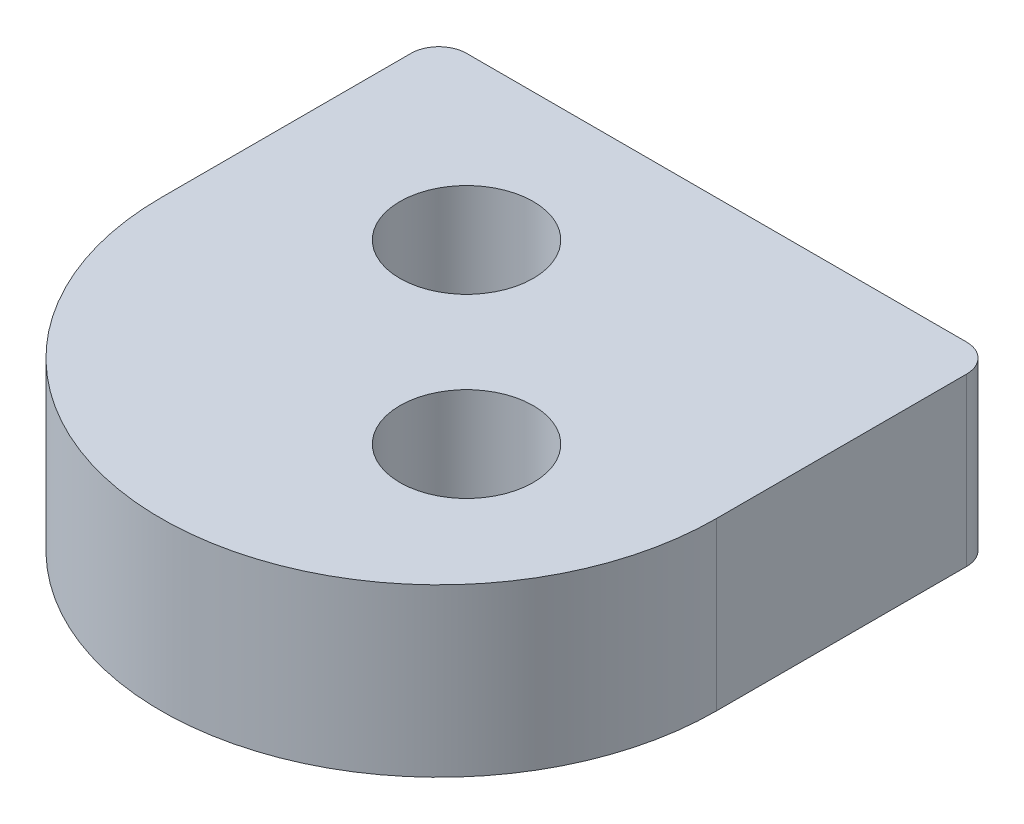
ISO-10303-21;
HEADER;
FILE_DESCRIPTION(('STEP AP214'),'2;1');
FILE_NAME('part.step','',(''),(''),'','','');
FILE_SCHEMA(('AUTOMOTIVE_DESIGN { 1 0 10303 214 1 1 1 1 }'));
ENDSEC;
DATA;
#1=APPLICATION_CONTEXT('core data for automotive mechanical design processes');
#2=APPLICATION_PROTOCOL_DEFINITION('international standard','automotive_design',2000,#1);
#3=PRODUCT_CONTEXT('',#1,'mechanical');
#4=PRODUCT('Part','Part','',(#3));
#5=PRODUCT_RELATED_PRODUCT_CATEGORY('part','',(#4));
#6=PRODUCT_DEFINITION_FORMATION('','',#4);
#7=PRODUCT_DEFINITION_CONTEXT('part definition',#1,'design');
#8=PRODUCT_DEFINITION('design','',#6,#7);
#9=PRODUCT_DEFINITION_SHAPE('','',#8);
#10=(LENGTH_UNIT() NAMED_UNIT(*) SI_UNIT(.MILLI.,.METRE.));
#11=(NAMED_UNIT(*) PLANE_ANGLE_UNIT() SI_UNIT($,.RADIAN.));
#12=(NAMED_UNIT(*) SI_UNIT($,.STERADIAN.) SOLID_ANGLE_UNIT());
#13=UNCERTAINTY_MEASURE_WITH_UNIT(LENGTH_MEASURE(1.E-05),#10,'distance_accuracy_value','');
#14=(GEOMETRIC_REPRESENTATION_CONTEXT(3) GLOBAL_UNCERTAINTY_ASSIGNED_CONTEXT((#13)) GLOBAL_UNIT_ASSIGNED_CONTEXT((#10,
#11,#12)) REPRESENTATION_CONTEXT('',''));
#15=CARTESIAN_POINT('',(0.,0.,0.));
#16=DIRECTION('',(0.,0.,1.));
#17=DIRECTION('',(1.,0.,0.));
#18=AXIS2_PLACEMENT_3D('',#15,#16,#17);
#19=CARTESIAN_POINT('',(-5.,-1.5,0.));
#20=DIRECTION('',(0.,-1.,0.));
#21=DIRECTION('',(0.,0.,-1.));
#22=AXIS2_PLACEMENT_3D('',#19,#20,#21);
#23=PLANE('',#22);
#24=DIRECTION('',(0.,0.,-1.));
#25=VECTOR('',#24,1.);
#26=CARTESIAN_POINT('',(-5.,-1.5,-37.5));
#27=LINE('',#26,#25);
#28=CARTESIAN_POINT('',(-4.99999999999998,-1.5,37.5));
#29=VERTEX_POINT('',#28);
#30=CARTESIAN_POINT('',(-4.99999999999998,-1.5,33.));
#31=VERTEX_POINT('',#30);
#32=EDGE_CURVE('E147',#29,#31,#27,.T.);
#33=ORIENTED_EDGE('',*,*,#32,.T.);
#34=CARTESIAN_POINT('',(-4.49999999999998,-1.5,33.));
#35=DIRECTION('',(0.,-1.,0.));
#36=DIRECTION('',(0.,0.,-1.));
#37=AXIS2_PLACEMENT_3D('',#34,#35,#36);
#38=CIRCLE('',#37,0.5);
#39=CARTESIAN_POINT('',(-4.50000000000728,-1.50000000002137,32.5));
#40=VERTEX_POINT('',#39);
#41=EDGE_CURVE('E53',#31,#40,#38,.T.);
#42=ORIENTED_EDGE('',*,*,#41,.T.);
#43=DIRECTION('',(-1.,0.,0.));
#44=VECTOR('',#43,1.);
#45=CARTESIAN_POINT('',(400000.,-1.50000000002137,32.5));
#46=LINE('',#45,#44);
#47=CARTESIAN_POINT('',(4.50000000000728,-1.50000000002137,32.5));
#48=VERTEX_POINT('',#47);
#49=EDGE_CURVE('E109',#48,#40,#46,.T.);
#50=ORIENTED_EDGE('',*,*,#49,.F.);
#51=CARTESIAN_POINT('',(4.49999999999999,-1.5,33.));
#52=DIRECTION('',(0.,-1.,0.));
#53=DIRECTION('',(0.,0.,-1.));
#54=AXIS2_PLACEMENT_3D('',#51,#52,#53);
#55=CIRCLE('',#54,0.5);
#56=CARTESIAN_POINT('',(4.99999999999997,-1.5,33.));
#57=VERTEX_POINT('',#56);
#58=EDGE_CURVE('E60',#48,#57,#55,.T.);
#59=ORIENTED_EDGE('',*,*,#58,.T.);
#60=DIRECTION('',(0.,0.,1.));
#61=VECTOR('',#60,1.);
#62=CARTESIAN_POINT('',(4.99999999999997,-1.5,0.));
#63=LINE('',#62,#61);
#64=CARTESIAN_POINT('',(4.99999999999999,-1.5,37.5));
#65=VERTEX_POINT('',#64);
#66=EDGE_CURVE('E122',#57,#65,#63,.T.);
#67=ORIENTED_EDGE('',*,*,#66,.T.);
#68=CARTESIAN_POINT('',(0.,-1.5,37.5));
#69=DIRECTION('',(0.,-1.,0.));
#70=DIRECTION('',(0.,0.,-1.));
#71=AXIS2_PLACEMENT_3D('',#68,#69,#70);
#72=CIRCLE('',#71,4.99999999999998);
#73=EDGE_CURVE('E105',#65,#29,#72,.T.);
#74=ORIENTED_EDGE('',*,*,#73,.T.);
#75=EDGE_LOOP('',(#33,#42,#50,#59,#67,#74));
#76=FACE_BOUND('',#75,.T.);
#77=CARTESIAN_POINT('',(1.59099025766973,-1.5,38.5909902576697));
#78=DIRECTION('',(0.,-1.,0.));
#79=DIRECTION('',(0.,0.,-1.));
#80=AXIS2_PLACEMENT_3D('',#77,#78,#79);
#81=CIRCLE('',#80,1.2);
#82=CARTESIAN_POINT('',(1.59099025766973,-1.5,37.3909902576697));
#83=VERTEX_POINT('',#82);
#84=EDGE_CURVE('E127',#83,#83,#81,.F.);
#85=ORIENTED_EDGE('',*,*,#84,.T.);
#86=EDGE_LOOP('',(#85));
#87=FACE_BOUND('',#86,.T.);
#88=CARTESIAN_POINT('',(-1.59099025766973,-1.5,35.4090097423302));
#89=DIRECTION('',(0.,-1.,0.));
#90=DIRECTION('',(0.,0.,-1.));
#91=AXIS2_PLACEMENT_3D('',#88,#89,#90);
#92=CIRCLE('',#91,1.2);
#93=CARTESIAN_POINT('',(-1.59099025766973,-1.5,34.2090097423302));
#94=VERTEX_POINT('',#93);
#95=EDGE_CURVE('E140',#94,#94,#92,.F.);
#96=ORIENTED_EDGE('',*,*,#95,.T.);
#97=EDGE_LOOP('',(#96));
#98=FACE_BOUND('',#97,.T.);
#99=ADVANCED_FACE('F44',(#76,#87,#98),#23,.T.);
#100=CARTESIAN_POINT('',(-5.,1.5,0.));
#101=DIRECTION('',(0.,1.,0.));
#102=DIRECTION('',(0.,0.,1.));
#103=AXIS2_PLACEMENT_3D('',#100,#101,#102);
#104=PLANE('',#103);
#105=DIRECTION('',(1.,0.,0.));
#106=VECTOR('',#105,1.);
#107=CARTESIAN_POINT('',(400000.,1.50000000002137,32.5));
#108=LINE('',#107,#106);
#109=CARTESIAN_POINT('',(-4.50000000000728,1.50000000002137,32.5));
#110=VERTEX_POINT('',#109);
#111=CARTESIAN_POINT('',(4.50000000000728,1.50000000002137,32.5));
#112=VERTEX_POINT('',#111);
#113=EDGE_CURVE('E158',#110,#112,#108,.T.);
#114=ORIENTED_EDGE('',*,*,#113,.F.);
#115=CARTESIAN_POINT('',(-4.49999999999998,1.5,33.));
#116=DIRECTION('',(0.,1.,0.));
#117=DIRECTION('',(0.,0.,1.));
#118=AXIS2_PLACEMENT_3D('',#115,#116,#117);
#119=CIRCLE('',#118,0.5);
#120=CARTESIAN_POINT('',(-4.99999999999998,1.5,33.));
#121=VERTEX_POINT('',#120);
#122=EDGE_CURVE('E170',#110,#121,#119,.T.);
#123=ORIENTED_EDGE('',*,*,#122,.T.);
#124=DIRECTION('',(0.,0.,1.));
#125=VECTOR('',#124,1.);
#126=CARTESIAN_POINT('',(-5.,1.5,-37.5));
#127=LINE('',#126,#125);
#128=CARTESIAN_POINT('',(-4.99999999999998,1.5,37.5));
#129=VERTEX_POINT('',#128);
#130=EDGE_CURVE('E119',#121,#129,#127,.T.);
#131=ORIENTED_EDGE('',*,*,#130,.T.);
#132=CARTESIAN_POINT('',(0.,1.5,37.5));
#133=DIRECTION('',(0.,1.,0.));
#134=DIRECTION('',(0.,0.,1.));
#135=AXIS2_PLACEMENT_3D('',#132,#133,#134);
#136=CIRCLE('',#135,4.99999999999998);
#137=CARTESIAN_POINT('',(4.99999999999999,1.5,37.5));
#138=VERTEX_POINT('',#137);
#139=EDGE_CURVE('E103',#129,#138,#136,.T.);
#140=ORIENTED_EDGE('',*,*,#139,.T.);
#141=DIRECTION('',(0.,0.,-1.));
#142=VECTOR('',#141,1.);
#143=CARTESIAN_POINT('',(4.99999999999997,1.5,-37.5));
#144=LINE('',#143,#142);
#145=CARTESIAN_POINT('',(4.99999999999999,1.5,33.));
#146=VERTEX_POINT('',#145);
#147=EDGE_CURVE('E117',#138,#146,#144,.T.);
#148=ORIENTED_EDGE('',*,*,#147,.T.);
#149=CARTESIAN_POINT('',(4.49999999999999,1.5,33.));
#150=DIRECTION('',(0.,1.,0.));
#151=DIRECTION('',(0.,0.,1.));
#152=AXIS2_PLACEMENT_3D('',#149,#150,#151);
#153=CIRCLE('',#152,0.5);
#154=EDGE_CURVE('E167',#146,#112,#153,.T.);
#155=ORIENTED_EDGE('',*,*,#154,.T.);
#156=EDGE_LOOP('',(#114,#123,#131,#140,#148,#155));
#157=FACE_BOUND('',#156,.T.);
#158=CARTESIAN_POINT('',(1.59099025766973,1.5,38.5909902576697));
#159=DIRECTION('',(0.,1.,0.));
#160=DIRECTION('',(0.,0.,1.));
#161=AXIS2_PLACEMENT_3D('',#158,#159,#160);
#162=CIRCLE('',#161,1.2);
#163=CARTESIAN_POINT('',(1.59099025766973,1.5,39.7909902576697));
#164=VERTEX_POINT('',#163);
#165=EDGE_CURVE('E133',#164,#164,#162,.F.);
#166=ORIENTED_EDGE('',*,*,#165,.T.);
#167=EDGE_LOOP('',(#166));
#168=FACE_BOUND('',#167,.T.);
#169=CARTESIAN_POINT('',(-1.59099025766973,1.5,35.4090097423302));
#170=DIRECTION('',(0.,1.,0.));
#171=DIRECTION('',(0.,0.,1.));
#172=AXIS2_PLACEMENT_3D('',#169,#170,#171);
#173=CIRCLE('',#172,1.2);
#174=CARTESIAN_POINT('',(-1.59099025766973,1.5,36.6090097423302));
#175=VERTEX_POINT('',#174);
#176=EDGE_CURVE('E141',#175,#175,#173,.F.);
#177=ORIENTED_EDGE('',*,*,#176,.T.);
#178=EDGE_LOOP('',(#177));
#179=FACE_BOUND('',#178,.T.);
#180=ADVANCED_FACE('F115',(#157,#168,#179),#104,.T.);
#181=CARTESIAN_POINT('',(-1.59099025766973,-4.,35.4090097423302));
#182=DIRECTION('',(0.,-1.,0.));
#183=DIRECTION('',(0.,0.,-1.));
#184=AXIS2_PLACEMENT_3D('',#181,#182,#183);
#185=CYLINDRICAL_SURFACE('',#184,1.2);
#186=ORIENTED_EDGE('',*,*,#176,.F.);
#187=EDGE_LOOP('',(#186));
#188=FACE_BOUND('',#187,.T.);
#189=ORIENTED_EDGE('',*,*,#95,.F.);
#190=EDGE_LOOP('',(#189));
#191=FACE_BOUND('',#190,.T.);
#192=ADVANCED_FACE('F204',(#188,#191),#185,.F.);
#193=CARTESIAN_POINT('',(1.59099025766973,-4.,38.5909902576697));
#194=DIRECTION('',(0.,-1.,0.));
#195=DIRECTION('',(0.,0.,-1.));
#196=AXIS2_PLACEMENT_3D('',#193,#194,#195);
#197=CYLINDRICAL_SURFACE('',#196,1.2);
#198=ORIENTED_EDGE('',*,*,#165,.F.);
#199=EDGE_LOOP('',(#198));
#200=FACE_BOUND('',#199,.T.);
#201=ORIENTED_EDGE('',*,*,#84,.F.);
#202=EDGE_LOOP('',(#201));
#203=FACE_BOUND('',#202,.T.);
#204=ADVANCED_FACE('F196',(#200,#203),#197,.F.);
#205=CARTESIAN_POINT('',(5.00000000000001,-5.01928464870704,32.5));
#206=DIRECTION('',(0.,0.,1.));
#207=DIRECTION('',(1.,0.,0.));
#208=AXIS2_PLACEMENT_3D('',#205,#206,#207);
#209=PLANE('',#208);
#210=ORIENTED_EDGE('',*,*,#49,.T.);
#211=DIRECTION('',(0.,1.,0.));
#212=VECTOR('',#211,1.);
#213=CARTESIAN_POINT('',(-4.49999999999998,-5.01928464870704,32.5));
#214=LINE('',#213,#212);
#215=EDGE_CURVE('E163',#40,#110,#214,.T.);
#216=ORIENTED_EDGE('',*,*,#215,.T.);
#217=ORIENTED_EDGE('',*,*,#113,.T.);
#218=DIRECTION('',(0.,-1.,0.));
#219=VECTOR('',#218,1.);
#220=CARTESIAN_POINT('',(4.49999999999999,-5.01928464870704,32.5));
#221=LINE('',#220,#219);
#222=EDGE_CURVE('E159',#112,#48,#221,.T.);
#223=ORIENTED_EDGE('',*,*,#222,.T.);
#224=EDGE_LOOP('',(#210,#216,#217,#223));
#225=FACE_BOUND('',#224,.T.);
#226=ADVANCED_FACE('F182',(#225),#209,.F.);
#227=CARTESIAN_POINT('',(4.99999999999997,4.,-37.5));
#228=DIRECTION('',(-1.,0.,0.));
#229=DIRECTION('',(0.,0.,1.));
#230=AXIS2_PLACEMENT_3D('',#227,#228,#229);
#231=PLANE('',#230);
#232=ORIENTED_EDGE('',*,*,#66,.F.);
#233=DIRECTION('',(0.,-1.,0.));
#234=VECTOR('',#233,1.);
#235=CARTESIAN_POINT('',(4.99999999999999,4.,33.));
#236=LINE('',#235,#234);
#237=EDGE_CURVE('E11',#57,#146,#236,.F.);
#238=ORIENTED_EDGE('',*,*,#237,.T.);
#239=ORIENTED_EDGE('',*,*,#147,.F.);
#240=DIRECTION('',(0.,-1.,0.));
#241=VECTOR('',#240,1.);
#242=CARTESIAN_POINT('',(4.99999999999999,4.,37.5));
#243=LINE('',#242,#241);
#244=EDGE_CURVE('E100',#138,#65,#243,.T.);
#245=ORIENTED_EDGE('',*,*,#244,.T.);
#246=EDGE_LOOP('',(#232,#238,#239,#245));
#247=FACE_BOUND('',#246,.T.);
#248=ADVANCED_FACE('F124',(#247),#231,.F.);
#249=CARTESIAN_POINT('',(-5.,4.,-37.5));
#250=DIRECTION('',(1.,0.,0.));
#251=DIRECTION('',(0.,0.,-1.));
#252=AXIS2_PLACEMENT_3D('',#249,#250,#251);
#253=PLANE('',#252);
#254=ORIENTED_EDGE('',*,*,#130,.F.);
#255=DIRECTION('',(0.,1.,0.));
#256=VECTOR('',#255,1.);
#257=CARTESIAN_POINT('',(-4.99999999999998,4.,33.));
#258=LINE('',#257,#256);
#259=EDGE_CURVE('E68',#121,#31,#258,.F.);
#260=ORIENTED_EDGE('',*,*,#259,.T.);
#261=ORIENTED_EDGE('',*,*,#32,.F.);
#262=DIRECTION('',(0.,-1.,0.));
#263=VECTOR('',#262,1.);
#264=CARTESIAN_POINT('',(-4.99999999999998,4.,37.5));
#265=LINE('',#264,#263);
#266=EDGE_CURVE('E110',#129,#29,#265,.T.);
#267=ORIENTED_EDGE('',*,*,#266,.F.);
#268=EDGE_LOOP('',(#254,#260,#261,#267));
#269=FACE_BOUND('',#268,.T.);
#270=ADVANCED_FACE('F186',(#269),#253,.F.);
#271=CARTESIAN_POINT('',(0.,4.,37.5));
#272=DIRECTION('',(0.,-1.,0.));
#273=DIRECTION('',(0.,0.,-1.));
#274=AXIS2_PLACEMENT_3D('',#271,#272,#273);
#275=CYLINDRICAL_SURFACE('',#274,4.99999999999998);
#276=ORIENTED_EDGE('',*,*,#73,.F.);
#277=ORIENTED_EDGE('',*,*,#244,.F.);
#278=ORIENTED_EDGE('',*,*,#139,.F.);
#279=ORIENTED_EDGE('',*,*,#266,.T.);
#280=EDGE_LOOP('',(#276,#277,#278,#279));
#281=FACE_BOUND('',#280,.T.);
#282=ADVANCED_FACE('F102',(#281),#275,.T.);
#283=CARTESIAN_POINT('',(-4.49999999999998,-5.01928464870704,33.));
#284=DIRECTION('',(0.,1.,0.));
#285=DIRECTION('',(0.,0.,1.));
#286=AXIS2_PLACEMENT_3D('',#283,#284,#285);
#287=CYLINDRICAL_SURFACE('',#286,0.5);
#288=ORIENTED_EDGE('',*,*,#41,.F.);
#289=ORIENTED_EDGE('',*,*,#259,.F.);
#290=ORIENTED_EDGE('',*,*,#122,.F.);
#291=ORIENTED_EDGE('',*,*,#215,.F.);
#292=EDGE_LOOP('',(#288,#289,#290,#291));
#293=FACE_BOUND('',#292,.T.);
#294=ADVANCED_FACE('F185',(#293),#287,.T.);
#295=CARTESIAN_POINT('',(4.49999999999999,-5.01928464870704,33.));
#296=DIRECTION('',(0.,-1.,0.));
#297=DIRECTION('',(0.,0.,-1.));
#298=AXIS2_PLACEMENT_3D('',#295,#296,#297);
#299=CYLINDRICAL_SURFACE('',#298,0.5);
#300=ORIENTED_EDGE('',*,*,#154,.F.);
#301=ORIENTED_EDGE('',*,*,#237,.F.);
#302=ORIENTED_EDGE('',*,*,#58,.F.);
#303=ORIENTED_EDGE('',*,*,#222,.F.);
#304=EDGE_LOOP('',(#300,#301,#302,#303));
#305=FACE_BOUND('',#304,.T.);
#306=ADVANCED_FACE('F46',(#305),#299,.T.);
#307=CLOSED_SHELL('',(#99,#180,#192,#204,#226,#248,#270,#282,#294,#306));
#308=MANIFOLD_SOLID_BREP('B2',#307);
#309=ADVANCED_BREP_SHAPE_REPRESENTATION('',(#18,#308),#14);
#310=SHAPE_DEFINITION_REPRESENTATION(#9,#309);
ENDSEC;
END-ISO-10303-21;
